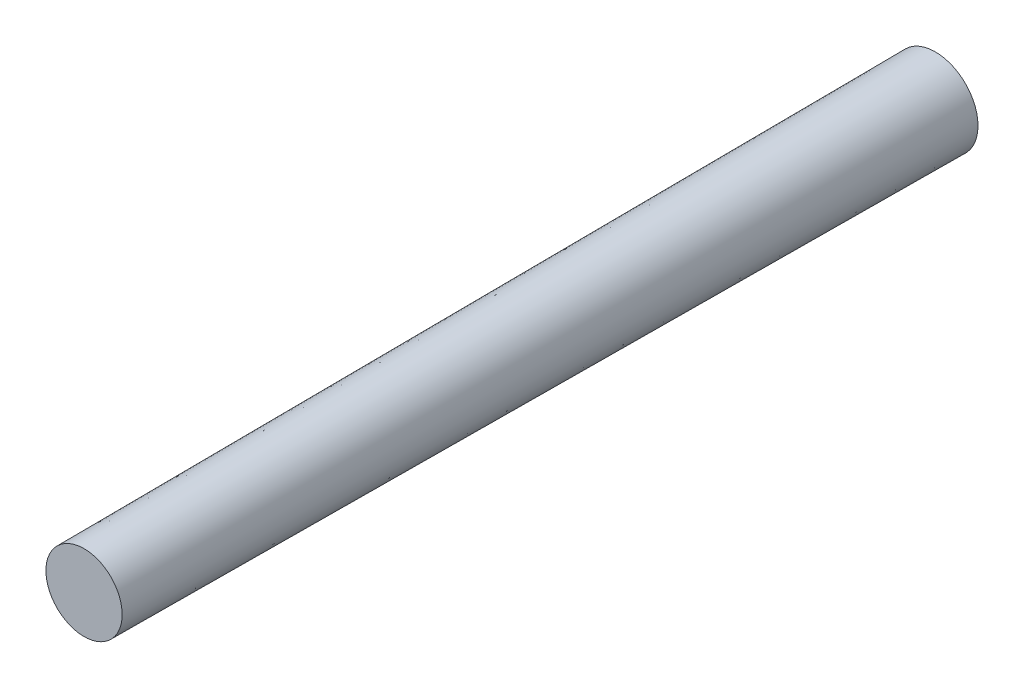
ISO-10303-21;
HEADER;
FILE_DESCRIPTION(('STEP AP214'),'2;1');
FILE_NAME('part.step','',(''),(''),'','','');
FILE_SCHEMA(('AUTOMOTIVE_DESIGN { 1 0 10303 214 1 1 1 1 }'));
ENDSEC;
DATA;
#1=APPLICATION_CONTEXT('core data for automotive mechanical design processes');
#2=APPLICATION_PROTOCOL_DEFINITION('international standard','automotive_design',2000,#1);
#3=PRODUCT_CONTEXT('',#1,'mechanical');
#4=PRODUCT('Part','Part','',(#3));
#5=PRODUCT_RELATED_PRODUCT_CATEGORY('part','',(#4));
#6=PRODUCT_DEFINITION_FORMATION('','',#4);
#7=PRODUCT_DEFINITION_CONTEXT('part definition',#1,'design');
#8=PRODUCT_DEFINITION('design','',#6,#7);
#9=PRODUCT_DEFINITION_SHAPE('','',#8);
#10=(LENGTH_UNIT() NAMED_UNIT(*) SI_UNIT(.MILLI.,.METRE.));
#11=(NAMED_UNIT(*) PLANE_ANGLE_UNIT() SI_UNIT($,.RADIAN.));
#12=(NAMED_UNIT(*) SI_UNIT($,.STERADIAN.) SOLID_ANGLE_UNIT());
#13=UNCERTAINTY_MEASURE_WITH_UNIT(LENGTH_MEASURE(1.E-05),#10,'distance_accuracy_value','');
#14=(GEOMETRIC_REPRESENTATION_CONTEXT(3) GLOBAL_UNCERTAINTY_ASSIGNED_CONTEXT((#13)) GLOBAL_UNIT_ASSIGNED_CONTEXT((#10,
#11,#12)) REPRESENTATION_CONTEXT('',''));
#15=CARTESIAN_POINT('',(0.,0.,0.));
#16=DIRECTION('',(0.,0.,1.));
#17=DIRECTION('',(1.,0.,0.));
#18=AXIS2_PLACEMENT_3D('',#15,#16,#17);
#19=CARTESIAN_POINT('',(0.,0.,0.));
#20=DIRECTION('',(0.,0.,-1.));
#21=DIRECTION('',(1.,0.,0.));
#22=AXIS2_PLACEMENT_3D('',#19,#20,#21);
#23=CONICAL_SURFACE('',#22,3.,0.005235987755983);
#24=CARTESIAN_POINT('',(0.,0.,60.));
#25=DIRECTION('',(0.,0.,1.));
#26=DIRECTION('',(1.,0.,0.));
#27=AXIS2_PLACEMENT_3D('',#24,#25,#26);
#28=CIRCLE('',#27,2.68583786365799);
#29=CARTESIAN_POINT('',(2.68583786365799,0.,60.));
#30=VERTEX_POINT('',#29);
#31=EDGE_CURVE('E10',#30,#30,#28,.T.);
#32=ORIENTED_EDGE('',*,*,#31,.F.);
#33=EDGE_LOOP('',(#32));
#34=FACE_BOUND('',#33,.T.);
#35=CARTESIAN_POINT('',(0.,0.,0.));
#36=DIRECTION('',(0.,0.,1.));
#37=DIRECTION('',(1.,0.,0.));
#38=AXIS2_PLACEMENT_3D('',#35,#36,#37);
#39=CIRCLE('',#38,3.);
#40=CARTESIAN_POINT('',(3.,0.,0.));
#41=VERTEX_POINT('',#40);
#42=EDGE_CURVE('E39',#41,#41,#39,.T.);
#43=ORIENTED_EDGE('',*,*,#42,.T.);
#44=EDGE_LOOP('',(#43));
#45=FACE_BOUND('',#44,.T.);
#46=ADVANCED_FACE('F33',(#34,#45),#23,.T.);
#47=CARTESIAN_POINT('',(0.,0.,60.));
#48=DIRECTION('',(0.,0.,1.));
#49=DIRECTION('',(1.,0.,0.));
#50=AXIS2_PLACEMENT_3D('',#47,#48,#49);
#51=PLANE('',#50);
#52=ORIENTED_EDGE('',*,*,#31,.T.);
#53=EDGE_LOOP('',(#52));
#54=FACE_BOUND('',#53,.T.);
#55=ADVANCED_FACE('F48',(#54),#51,.T.);
#56=CARTESIAN_POINT('',(0.,0.,0.));
#57=DIRECTION('',(0.,0.,1.));
#58=DIRECTION('',(1.,0.,0.));
#59=AXIS2_PLACEMENT_3D('',#56,#57,#58);
#60=PLANE('',#59);
#61=ORIENTED_EDGE('',*,*,#42,.F.);
#62=EDGE_LOOP('',(#61));
#63=FACE_BOUND('',#62,.T.);
#64=ADVANCED_FACE('F46',(#63),#60,.F.);
#65=CLOSED_SHELL('',(#46,#55,#64));
#66=MANIFOLD_SOLID_BREP('B2',#65);
#67=ADVANCED_BREP_SHAPE_REPRESENTATION('',(#18,#66),#14);
#68=SHAPE_DEFINITION_REPRESENTATION(#9,#67);
ENDSEC;
END-ISO-10303-21;
